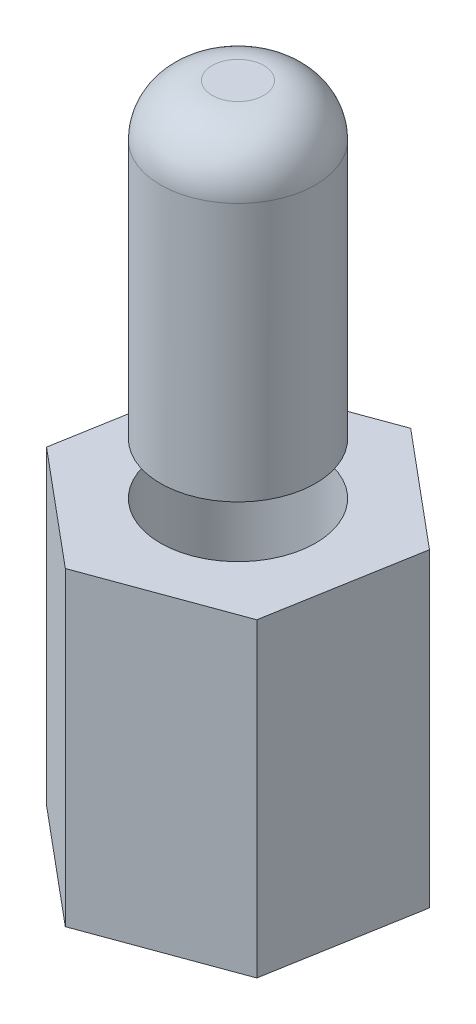
ISO-10303-21;
HEADER;
FILE_DESCRIPTION(('STEP AP214'),'2;1');
FILE_NAME('part.step','',(''),(''),'','','');
FILE_SCHEMA(('AUTOMOTIVE_DESIGN { 1 0 10303 214 1 1 1 1 }'));
ENDSEC;
DATA;
#1=APPLICATION_CONTEXT('core data for automotive mechanical design processes');
#2=APPLICATION_PROTOCOL_DEFINITION('international standard','automotive_design',2000,#1);
#3=PRODUCT_CONTEXT('',#1,'mechanical');
#4=PRODUCT('Part','Part','',(#3));
#5=PRODUCT_RELATED_PRODUCT_CATEGORY('part','',(#4));
#6=PRODUCT_DEFINITION_FORMATION('','',#4);
#7=PRODUCT_DEFINITION_CONTEXT('part definition',#1,'design');
#8=PRODUCT_DEFINITION('design','',#6,#7);
#9=PRODUCT_DEFINITION_SHAPE('','',#8);
#10=(LENGTH_UNIT() NAMED_UNIT(*) SI_UNIT(.MILLI.,.METRE.));
#11=(NAMED_UNIT(*) PLANE_ANGLE_UNIT() SI_UNIT($,.RADIAN.));
#12=(NAMED_UNIT(*) SI_UNIT($,.STERADIAN.) SOLID_ANGLE_UNIT());
#13=UNCERTAINTY_MEASURE_WITH_UNIT(LENGTH_MEASURE(1.E-05),#10,'distance_accuracy_value','');
#14=(GEOMETRIC_REPRESENTATION_CONTEXT(3) GLOBAL_UNCERTAINTY_ASSIGNED_CONTEXT((#13)) GLOBAL_UNIT_ASSIGNED_CONTEXT((#10,
#11,#12)) REPRESENTATION_CONTEXT('',''));
#15=CARTESIAN_POINT('',(0.,0.,0.));
#16=DIRECTION('',(0.,0.,1.));
#17=DIRECTION('',(1.,0.,0.));
#18=AXIS2_PLACEMENT_3D('',#15,#16,#17);
#19=CARTESIAN_POINT('',(-0.495994709202007,6.,2.84382182665809));
#20=DIRECTION('',(-0.343765976383913,0.,-0.939055351659749));
#21=DIRECTION('',(-0.939055351659749,0.,0.343765976383913));
#22=AXIS2_PLACEMENT_3D('',#19,#20,#21);
#23=PLANE('',#22);
#24=DIRECTION('',(0.939055351659749,0.,-0.343765976383913));
#25=VECTOR('',#24,1.);
#26=CARTESIAN_POINT('',(-0.495994709202007,0.,2.84382182665809));
#27=LINE('',#26,#25);
#28=CARTESIAN_POINT('',(-0.495994709202007,0.,2.84382182665809));
#29=VERTEX_POINT('',#28);
#30=CARTESIAN_POINT('',(2.21482459112157,0.,1.85145493164066));
#31=VERTEX_POINT('',#30);
#32=EDGE_CURVE('E139',#29,#31,#27,.T.);
#33=ORIENTED_EDGE('',*,*,#32,.T.);
#34=DIRECTION('',(0.,-1.,0.));
#35=VECTOR('',#34,1.);
#36=CARTESIAN_POINT('',(2.21482459112157,6.,1.85145493164066));
#37=LINE('',#36,#35);
#38=CARTESIAN_POINT('',(2.21482459112157,6.,1.85145493164066));
#39=VERTEX_POINT('',#38);
#40=EDGE_CURVE('E119',#39,#31,#37,.T.);
#41=ORIENTED_EDGE('',*,*,#40,.F.);
#42=DIRECTION('',(0.939055351659749,0.,-0.343765976383913));
#43=VECTOR('',#42,1.);
#44=CARTESIAN_POINT('',(-0.495994709202007,6.,2.84382182665809));
#45=LINE('',#44,#43);
#46=CARTESIAN_POINT('',(-0.495994709202007,6.,2.84382182665809));
#47=VERTEX_POINT('',#46);
#48=EDGE_CURVE('E155',#47,#39,#45,.T.);
#49=ORIENTED_EDGE('',*,*,#48,.F.);
#50=DIRECTION('',(0.,-1.,0.));
#51=VECTOR('',#50,1.);
#52=CARTESIAN_POINT('',(-0.495994709202007,6.,2.84382182665809));
#53=LINE('',#52,#51);
#54=EDGE_CURVE('E122',#47,#29,#53,.T.);
#55=ORIENTED_EDGE('',*,*,#54,.T.);
#56=EDGE_LOOP('',(#33,#41,#49,#55));
#57=FACE_BOUND('',#56,.T.);
#58=ADVANCED_FACE('F51',(#57),#23,.F.);
#59=CARTESIAN_POINT('',(2.21482459112157,6.,1.85145493164066));
#60=DIRECTION('',(-0.985128778289029,0.,-0.171817607324645));
#61=DIRECTION('',(-0.171817607324645,0.,0.985128778289029));
#62=AXIS2_PLACEMENT_3D('',#59,#60,#61);
#63=PLANE('',#62);
#64=DIRECTION('',(0.171817607324645,0.,-0.985128778289029));
#65=VECTOR('',#64,1.);
#66=CARTESIAN_POINT('',(2.21482459112157,0.,1.85145493164066));
#67=LINE('',#66,#65);
#68=CARTESIAN_POINT('',(2.71081930032357,0.,-0.992366895017432));
#69=VERTEX_POINT('',#68);
#70=EDGE_CURVE('E69',#31,#69,#67,.T.);
#71=ORIENTED_EDGE('',*,*,#70,.T.);
#72=DIRECTION('',(0.,-1.,0.));
#73=VECTOR('',#72,1.);
#74=CARTESIAN_POINT('',(2.71081930032357,6.,-0.992366895017432));
#75=LINE('',#74,#73);
#76=CARTESIAN_POINT('',(2.71081930032357,6.,-0.992366895017432));
#77=VERTEX_POINT('',#76);
#78=EDGE_CURVE('E116',#77,#69,#75,.T.);
#79=ORIENTED_EDGE('',*,*,#78,.F.);
#80=DIRECTION('',(0.171817607324645,0.,-0.985128778289029));
#81=VECTOR('',#80,1.);
#82=CARTESIAN_POINT('',(2.21482459112157,6.,1.85145493164066));
#83=LINE('',#82,#81);
#84=EDGE_CURVE('E91',#39,#77,#83,.T.);
#85=ORIENTED_EDGE('',*,*,#84,.F.);
#86=ORIENTED_EDGE('',*,*,#40,.T.);
#87=EDGE_LOOP('',(#71,#79,#85,#86));
#88=FACE_BOUND('',#87,.T.);
#89=ADVANCED_FACE('F115',(#88),#63,.F.);
#90=CARTESIAN_POINT('',(2.71081930032357,6.,-0.992366895017432));
#91=DIRECTION('',(-0.641362801905116,0.,0.767237744335104));
#92=DIRECTION('',(0.767237744335104,0.,0.641362801905116));
#93=AXIS2_PLACEMENT_3D('',#90,#91,#92);
#94=PLANE('',#93);
#95=DIRECTION('',(-0.767237744335104,0.,-0.641362801905116));
#96=VECTOR('',#95,1.);
#97=CARTESIAN_POINT('',(2.71081930032357,0.,-0.992366895017432));
#98=LINE('',#97,#96);
#99=CARTESIAN_POINT('',(0.495994709202006,0.,-2.84382182665809));
#100=VERTEX_POINT('',#99);
#101=EDGE_CURVE('E112',#69,#100,#98,.T.);
#102=ORIENTED_EDGE('',*,*,#101,.T.);
#103=DIRECTION('',(0.,-1.,0.));
#104=VECTOR('',#103,1.);
#105=CARTESIAN_POINT('',(0.495994709202006,6.,-2.84382182665809));
#106=LINE('',#105,#104);
#107=CARTESIAN_POINT('',(0.495994709202006,6.,-2.84382182665809));
#108=VERTEX_POINT('',#107);
#109=EDGE_CURVE('E181',#108,#100,#106,.T.);
#110=ORIENTED_EDGE('',*,*,#109,.F.);
#111=DIRECTION('',(-0.767237744335104,0.,-0.641362801905116));
#112=VECTOR('',#111,1.);
#113=CARTESIAN_POINT('',(2.71081930032357,6.,-0.992366895017432));
#114=LINE('',#113,#112);
#115=EDGE_CURVE('E125',#77,#108,#114,.T.);
#116=ORIENTED_EDGE('',*,*,#115,.F.);
#117=ORIENTED_EDGE('',*,*,#78,.T.);
#118=EDGE_LOOP('',(#102,#110,#116,#117));
#119=FACE_BOUND('',#118,.T.);
#120=ADVANCED_FACE('F124',(#119),#94,.F.);
#121=CARTESIAN_POINT('',(0.495994709202006,6.,-2.84382182665809));
#122=DIRECTION('',(0.343765976383912,0.,0.939055351659749));
#123=DIRECTION('',(0.93905535165975,0.,-0.343765976383912));
#124=AXIS2_PLACEMENT_3D('',#121,#122,#123);
#125=PLANE('',#124);
#126=DIRECTION('',(-0.939055351659749,0.,0.343765976383912));
#127=VECTOR('',#126,1.);
#128=CARTESIAN_POINT('',(0.495994709202006,0.,-2.84382182665809));
#129=LINE('',#128,#127);
#130=CARTESIAN_POINT('',(-2.21482459112157,0.,-1.85145493164066));
#131=VERTEX_POINT('',#130);
#132=EDGE_CURVE('E127',#100,#131,#129,.T.);
#133=ORIENTED_EDGE('',*,*,#132,.T.);
#134=DIRECTION('',(0.,-1.,0.));
#135=VECTOR('',#134,1.);
#136=CARTESIAN_POINT('',(-2.21482459112157,6.,-1.85145493164066));
#137=LINE('',#136,#135);
#138=CARTESIAN_POINT('',(-2.21482459112157,6.,-1.85145493164066));
#139=VERTEX_POINT('',#138);
#140=EDGE_CURVE('E172',#139,#131,#137,.T.);
#141=ORIENTED_EDGE('',*,*,#140,.F.);
#142=DIRECTION('',(-0.939055351659749,0.,0.343765976383912));
#143=VECTOR('',#142,1.);
#144=CARTESIAN_POINT('',(0.495994709202006,6.,-2.84382182665809));
#145=LINE('',#144,#143);
#146=EDGE_CURVE('E148',#108,#139,#145,.T.);
#147=ORIENTED_EDGE('',*,*,#146,.F.);
#148=ORIENTED_EDGE('',*,*,#109,.T.);
#149=EDGE_LOOP('',(#133,#141,#147,#148));
#150=FACE_BOUND('',#149,.T.);
#151=ADVANCED_FACE('F190',(#150),#125,.F.);
#152=CARTESIAN_POINT('',(-2.21482459112157,6.,-1.85145493164066));
#153=DIRECTION('',(0.985128778289029,0.,0.171817607324645));
#154=DIRECTION('',(0.171817607324645,0.,-0.985128778289029));
#155=AXIS2_PLACEMENT_3D('',#152,#153,#154);
#156=PLANE('',#155);
#157=DIRECTION('',(-0.171817607324645,0.,0.985128778289029));
#158=VECTOR('',#157,1.);
#159=CARTESIAN_POINT('',(-2.21482459112157,0.,-1.85145493164066));
#160=LINE('',#159,#158);
#161=CARTESIAN_POINT('',(-2.71081930032357,0.,0.992366895017432));
#162=VERTEX_POINT('',#161);
#163=EDGE_CURVE('E170',#131,#162,#160,.T.);
#164=ORIENTED_EDGE('',*,*,#163,.T.);
#165=DIRECTION('',(0.,-1.,0.));
#166=VECTOR('',#165,1.);
#167=CARTESIAN_POINT('',(-2.71081930032357,6.,0.992366895017432));
#168=LINE('',#167,#166);
#169=CARTESIAN_POINT('',(-2.71081930032357,6.,0.992366895017432));
#170=VERTEX_POINT('',#169);
#171=EDGE_CURVE('E157',#170,#162,#168,.T.);
#172=ORIENTED_EDGE('',*,*,#171,.F.);
#173=DIRECTION('',(-0.171817607324645,0.,0.985128778289029));
#174=VECTOR('',#173,1.);
#175=CARTESIAN_POINT('',(-2.21482459112157,6.,-1.85145493164066));
#176=LINE('',#175,#174);
#177=EDGE_CURVE('E145',#139,#170,#176,.T.);
#178=ORIENTED_EDGE('',*,*,#177,.F.);
#179=ORIENTED_EDGE('',*,*,#140,.T.);
#180=EDGE_LOOP('',(#164,#172,#178,#179));
#181=FACE_BOUND('',#180,.T.);
#182=ADVANCED_FACE('F192',(#181),#156,.F.);
#183=CARTESIAN_POINT('',(-2.71081930032357,6.,0.992366895017432));
#184=DIRECTION('',(0.641362801905116,0.,-0.767237744335104));
#185=DIRECTION('',(-0.767237744335104,0.,-0.641362801905116));
#186=AXIS2_PLACEMENT_3D('',#183,#184,#185);
#187=PLANE('',#186);
#188=DIRECTION('',(0.767237744335104,0.,0.641362801905116));
#189=VECTOR('',#188,1.);
#190=CARTESIAN_POINT('',(-2.71081930032357,0.,0.992366895017432));
#191=LINE('',#190,#189);
#192=EDGE_CURVE('E100',#162,#29,#191,.T.);
#193=ORIENTED_EDGE('',*,*,#192,.T.);
#194=ORIENTED_EDGE('',*,*,#54,.F.);
#195=DIRECTION('',(0.767237744335104,0.,0.641362801905116));
#196=VECTOR('',#195,1.);
#197=CARTESIAN_POINT('',(-2.71081930032357,6.,0.992366895017432));
#198=LINE('',#197,#196);
#199=EDGE_CURVE('E142',#170,#47,#198,.T.);
#200=ORIENTED_EDGE('',*,*,#199,.F.);
#201=ORIENTED_EDGE('',*,*,#171,.T.);
#202=EDGE_LOOP('',(#193,#194,#200,#201));
#203=FACE_BOUND('',#202,.T.);
#204=ADVANCED_FACE('F166',(#203),#187,.F.);
#205=CARTESIAN_POINT('',(0.,6.,0.));
#206=DIRECTION('',(0.,1.,0.));
#207=DIRECTION('',(0.,0.,1.));
#208=AXIS2_PLACEMENT_3D('',#205,#206,#207);
#209=PLANE('',#208);
#210=CARTESIAN_POINT('',(0.,6.,0.));
#211=DIRECTION('',(0.,1.,0.));
#212=DIRECTION('',(0.,0.,1.));
#213=AXIS2_PLACEMENT_3D('',#210,#211,#212);
#214=CIRCLE('',#213,1.5);
#215=CARTESIAN_POINT('',(0.,6.,1.5));
#216=VERTEX_POINT('',#215);
#217=EDGE_CURVE('E61',#216,#216,#214,.T.);
#218=ORIENTED_EDGE('',*,*,#217,.F.);
#219=EDGE_LOOP('',(#218));
#220=FACE_BOUND('',#219,.T.);
#221=ORIENTED_EDGE('',*,*,#48,.T.);
#222=ORIENTED_EDGE('',*,*,#84,.T.);
#223=ORIENTED_EDGE('',*,*,#115,.T.);
#224=ORIENTED_EDGE('',*,*,#146,.T.);
#225=ORIENTED_EDGE('',*,*,#177,.T.);
#226=ORIENTED_EDGE('',*,*,#199,.T.);
#227=EDGE_LOOP('',(#221,#222,#223,#224,#225,#226));
#228=FACE_BOUND('',#227,.T.);
#229=ADVANCED_FACE('F164',(#220,#228),#209,.T.);
#230=CARTESIAN_POINT('',(0.,0.,0.));
#231=DIRECTION('',(0.,1.,0.));
#232=DIRECTION('',(0.,0.,1.));
#233=AXIS2_PLACEMENT_3D('',#230,#231,#232);
#234=PLANE('',#233);
#235=CARTESIAN_POINT('',(0.,0.,0.));
#236=DIRECTION('',(0.,-1.,0.));
#237=DIRECTION('',(0.,0.,-1.));
#238=AXIS2_PLACEMENT_3D('',#235,#236,#237);
#239=CIRCLE('',#238,1.5);
#240=CARTESIAN_POINT('',(0.,0.,-1.5));
#241=VERTEX_POINT('',#240);
#242=EDGE_CURVE('E12',#241,#241,#239,.T.);
#243=ORIENTED_EDGE('',*,*,#242,.F.);
#244=EDGE_LOOP('',(#243));
#245=FACE_BOUND('',#244,.T.);
#246=ORIENTED_EDGE('',*,*,#32,.F.);
#247=ORIENTED_EDGE('',*,*,#192,.F.);
#248=ORIENTED_EDGE('',*,*,#163,.F.);
#249=ORIENTED_EDGE('',*,*,#132,.F.);
#250=ORIENTED_EDGE('',*,*,#101,.F.);
#251=ORIENTED_EDGE('',*,*,#70,.F.);
#252=EDGE_LOOP('',(#246,#247,#248,#249,#250,#251));
#253=FACE_BOUND('',#252,.T.);
#254=ADVANCED_FACE('F130',(#245,#253),#234,.F.);
#255=CARTESIAN_POINT('',(0.,7.,0.));
#256=DIRECTION('',(0.,-1.,0.));
#257=DIRECTION('',(0.,0.,-1.));
#258=AXIS2_PLACEMENT_3D('',#255,#256,#257);
#259=CYLINDRICAL_SURFACE('',#258,1.5);
#260=ORIENTED_EDGE('',*,*,#217,.T.);
#261=EDGE_LOOP('',(#260));
#262=FACE_BOUND('',#261,.T.);
#263=ORIENTED_EDGE('',*,*,#242,.T.);
#264=EDGE_LOOP('',(#263));
#265=FACE_BOUND('',#264,.T.);
#266=ADVANCED_FACE('F53',(#262,#265),#259,.F.);
#267=CLOSED_SHELL('',(#58,#89,#120,#151,#182,#204,#229,#254,#266));
#268=MANIFOLD_SOLID_BREP('B2',#267);
#269=CARTESIAN_POINT('',(0.,13.,0.));
#270=DIRECTION('',(0.,1.,0.));
#271=DIRECTION('',(0.,0.,1.));
#272=AXIS2_PLACEMENT_3D('',#269,#270,#271);
#273=PLANE('',#272);
#274=CARTESIAN_POINT('',(0.,13.,0.));
#275=DIRECTION('',(0.,1.,0.));
#276=DIRECTION('',(0.,0.,1.));
#277=AXIS2_PLACEMENT_3D('',#274,#275,#276);
#278=CIRCLE('',#277,0.5);
#279=CARTESIAN_POINT('',(0.,13.,0.5));
#280=VERTEX_POINT('',#279);
#281=EDGE_CURVE('E293',#280,#280,#278,.T.);
#282=ORIENTED_EDGE('',*,*,#281,.T.);
#283=EDGE_LOOP('',(#282));
#284=FACE_BOUND('',#283,.T.);
#285=ADVANCED_FACE('F286',(#284),#273,.T.);
#286=CARTESIAN_POINT('',(0.,13.,0.));
#287=DIRECTION('',(0.,-1.,0.));
#288=DIRECTION('',(0.,0.,-1.));
#289=AXIS2_PLACEMENT_3D('',#286,#287,#288);
#290=CYLINDRICAL_SURFACE('',#289,1.5);
#291=CARTESIAN_POINT('',(0.,12.,0.));
#292=DIRECTION('',(0.,1.,0.));
#293=DIRECTION('',(0.,0.,1.));
#294=AXIS2_PLACEMENT_3D('',#291,#292,#293);
#295=CIRCLE('',#294,1.5);
#296=CARTESIAN_POINT('',(0.,12.,1.5));
#297=VERTEX_POINT('',#296);
#298=EDGE_CURVE('E50',#297,#297,#295,.F.);
#299=ORIENTED_EDGE('',*,*,#298,.T.);
#300=EDGE_LOOP('',(#299));
#301=FACE_BOUND('',#300,.T.);
#302=CARTESIAN_POINT('',(0.,7.,0.));
#303=DIRECTION('',(0.,-1.,0.));
#304=DIRECTION('',(0.,0.,-1.));
#305=AXIS2_PLACEMENT_3D('',#302,#303,#304);
#306=CIRCLE('',#305,1.5);
#307=CARTESIAN_POINT('',(0.,7.,-1.5));
#308=VERTEX_POINT('',#307);
#309=EDGE_CURVE('E297',#308,#308,#306,.T.);
#310=ORIENTED_EDGE('',*,*,#309,.F.);
#311=EDGE_LOOP('',(#310));
#312=FACE_BOUND('',#311,.T.);
#313=ADVANCED_FACE('F306',(#301,#312),#290,.T.);
#314=CARTESIAN_POINT('',(0.,7.,0.));
#315=DIRECTION('',(0.,-1.,0.));
#316=DIRECTION('',(0.,0.,-1.));
#317=AXIS2_PLACEMENT_3D('',#314,#315,#316);
#318=PLANE('',#317);
#319=ORIENTED_EDGE('',*,*,#309,.T.);
#320=EDGE_LOOP('',(#319));
#321=FACE_BOUND('',#320,.T.);
#322=ADVANCED_FACE('F304',(#321),#318,.T.);
#323=CARTESIAN_POINT('',(0.,12.,0.));
#324=DIRECTION('',(0.,1.,0.));
#325=DIRECTION('',(0.,0.,1.));
#326=AXIS2_PLACEMENT_3D('',#323,#324,#325);
#327=DEGENERATE_TOROIDAL_SURFACE('',#326,0.5,1.,.T.);
#328=ORIENTED_EDGE('',*,*,#298,.F.);
#329=EDGE_LOOP('',(#328));
#330=FACE_BOUND('',#329,.T.);
#331=ORIENTED_EDGE('',*,*,#281,.F.);
#332=EDGE_LOOP('',(#331));
#333=FACE_BOUND('',#332,.T.);
#334=ADVANCED_FACE('F288',(#330,#333),#327,.T.);
#335=CLOSED_SHELL('',(#285,#313,#322,#334));
#336=MANIFOLD_SOLID_BREP('B6',#335);
#337=ADVANCED_BREP_SHAPE_REPRESENTATION('',(#18,#268,#336),#14);
#338=SHAPE_DEFINITION_REPRESENTATION(#9,#337);
ENDSEC;
END-ISO-10303-21;
